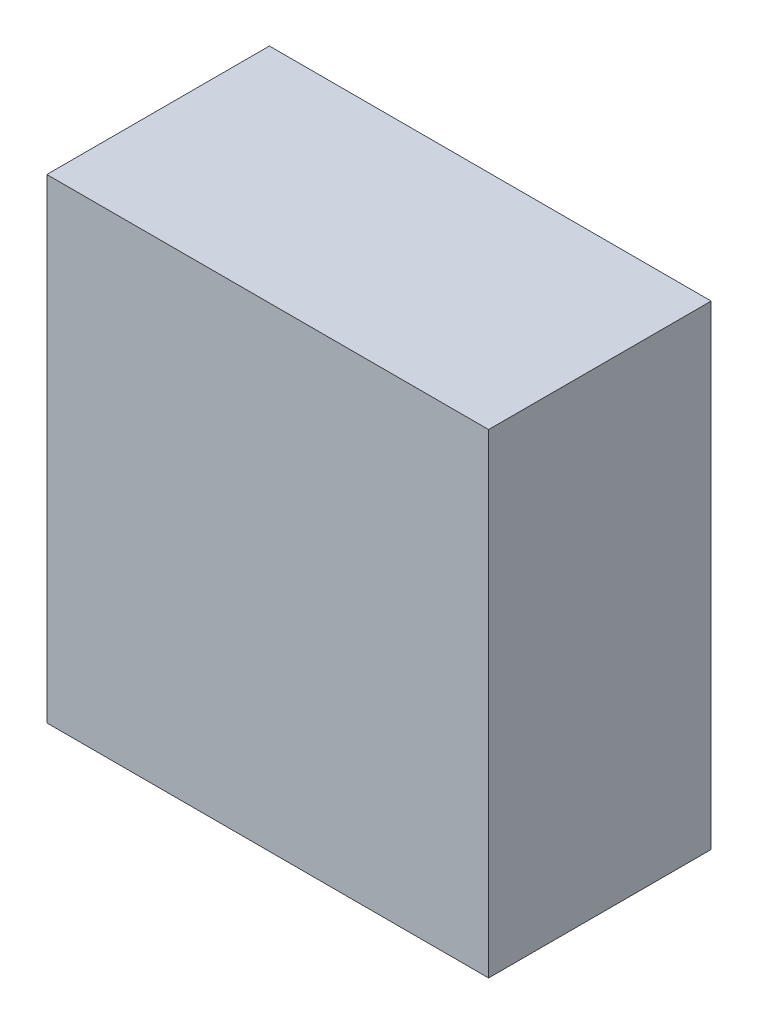
ISO-10303-21;
HEADER;
FILE_DESCRIPTION(('STEP AP214'),'2;1');
FILE_NAME('part.step','',(''),(''),'','','');
FILE_SCHEMA(('AUTOMOTIVE_DESIGN { 1 0 10303 214 1 1 1 1 }'));
ENDSEC;
DATA;
#1=APPLICATION_CONTEXT('core data for automotive mechanical design processes');
#2=APPLICATION_PROTOCOL_DEFINITION('international standard','automotive_design',2000,#1);
#3=PRODUCT_CONTEXT('',#1,'mechanical');
#4=PRODUCT('Part','Part','',(#3));
#5=PRODUCT_RELATED_PRODUCT_CATEGORY('part','',(#4));
#6=PRODUCT_DEFINITION_FORMATION('','',#4);
#7=PRODUCT_DEFINITION_CONTEXT('part definition',#1,'design');
#8=PRODUCT_DEFINITION('design','',#6,#7);
#9=PRODUCT_DEFINITION_SHAPE('','',#8);
#10=(LENGTH_UNIT() NAMED_UNIT(*) SI_UNIT(.MILLI.,.METRE.));
#11=(NAMED_UNIT(*) PLANE_ANGLE_UNIT() SI_UNIT($,.RADIAN.));
#12=(NAMED_UNIT(*) SI_UNIT($,.STERADIAN.) SOLID_ANGLE_UNIT());
#13=UNCERTAINTY_MEASURE_WITH_UNIT(LENGTH_MEASURE(1.E-05),#10,'distance_accuracy_value','');
#14=(GEOMETRIC_REPRESENTATION_CONTEXT(3) GLOBAL_UNCERTAINTY_ASSIGNED_CONTEXT((#13)) GLOBAL_UNIT_ASSIGNED_CONTEXT((#10,
#11,#12)) REPRESENTATION_CONTEXT('',''));
#15=CARTESIAN_POINT('',(0.,0.,0.));
#16=DIRECTION('',(0.,0.,1.));
#17=DIRECTION('',(1.,0.,0.));
#18=AXIS2_PLACEMENT_3D('',#15,#16,#17);
#19=CARTESIAN_POINT('',(-0.00534350019987609,-0.617441590055831,0.404766421000566));
#20=DIRECTION('',(0.,0.,1.));
#21=DIRECTION('',(1.,0.,0.));
#22=AXIS2_PLACEMENT_3D('',#19,#20,#21);
#23=PLANE('',#22);
#24=DIRECTION('',(1.01196828694583E-13,-1.,0.));
#25=VECTOR('',#24,1.);
#26=CARTESIAN_POINT('',(0.0690932947055984,-0.697470191516662,0.404766421000566));
#27=LINE('',#26,#25);
#28=CARTESIAN_POINT('',(0.0690932947055902,-0.537412988594928,0.404766421000566));
#29=VERTEX_POINT('',#28);
#30=CARTESIAN_POINT('',(0.0690932947055984,-0.69747019151667,0.404766421000566));
#31=VERTEX_POINT('',#30);
#32=EDGE_CURVE('E11',#29,#31,#27,.T.);
#33=ORIENTED_EDGE('',*,*,#32,.F.);
#34=DIRECTION('',(1.,1.01196828694583E-13,0.));
#35=VECTOR('',#34,1.);
#36=CARTESIAN_POINT('',(0.0690932947055821,-0.537412988594928,0.404766421000566));
#37=LINE('',#36,#35);
#38=CARTESIAN_POINT('',(-0.0797802951052936,-0.537412988594939,0.404766421000566));
#39=VERTEX_POINT('',#38);
#40=EDGE_CURVE('E24',#39,#29,#37,.T.);
#41=ORIENTED_EDGE('',*,*,#40,.F.);
#42=DIRECTION('',(-1.01196828694583E-13,1.,0.));
#43=VECTOR('',#42,1.);
#44=CARTESIAN_POINT('',(-0.0797802951052936,-0.537412988594943,0.404766421000566));
#45=LINE('',#44,#43);
#46=CARTESIAN_POINT('',(-0.0797802951052855,-0.697470191516678,0.404766421000566));
#47=VERTEX_POINT('',#46);
#48=EDGE_CURVE('E85',#47,#39,#45,.T.);
#49=ORIENTED_EDGE('',*,*,#48,.F.);
#50=DIRECTION('',(-1.,-1.01196828694583E-13,0.));
#51=VECTOR('',#50,1.);
#52=CARTESIAN_POINT('',(0.0690932947055984,-0.697470191516662,0.404766421000566));
#53=LINE('',#52,#51);
#54=EDGE_CURVE('E82',#31,#47,#53,.T.);
#55=ORIENTED_EDGE('',*,*,#54,.F.);
#56=EDGE_LOOP('',(#33,#41,#49,#55));
#57=FACE_BOUND('',#56,.T.);
#58=ADVANCED_FACE('F17',(#57),#23,.T.);
#59=CARTESIAN_POINT('',(-0.0797802951052936,-0.537412988594943,0.379766421000566));
#60=DIRECTION('',(-1.,-1.01196828694583E-13,0.));
#61=DIRECTION('',(1.01196828694583E-13,-1.,0.));
#62=AXIS2_PLACEMENT_3D('',#59,#60,#61);
#63=PLANE('',#62);
#64=ORIENTED_EDGE('',*,*,#48,.T.);
#65=DIRECTION('',(0.,0.,1.));
#66=VECTOR('',#65,1.);
#67=CARTESIAN_POINT('',(-0.0797802951052936,-0.537412988594943,0.379766421000566));
#68=LINE('',#67,#66);
#69=CARTESIAN_POINT('',(-0.0797802951052936,-0.537412988594939,0.329766421000566));
#70=VERTEX_POINT('',#69);
#71=EDGE_CURVE('E80',#70,#39,#68,.T.);
#72=ORIENTED_EDGE('',*,*,#71,.F.);
#73=DIRECTION('',(0.,-1.,0.));
#74=VECTOR('',#73,1.);
#75=CARTESIAN_POINT('',(-0.0797802951052936,-0.617441590055831,0.329766421000566));
#76=LINE('',#75,#74);
#77=CARTESIAN_POINT('',(-0.0797802951052814,-0.697470191516678,0.329766421000566));
#78=VERTEX_POINT('',#77);
#79=EDGE_CURVE('E70',#70,#78,#76,.T.);
#80=ORIENTED_EDGE('',*,*,#79,.T.);
#81=DIRECTION('',(0.,0.,-1.));
#82=VECTOR('',#81,1.);
#83=CARTESIAN_POINT('',(-0.0797802951052773,-0.697470191516678,0.379766421000566));
#84=LINE('',#83,#82);
#85=EDGE_CURVE('E76',#47,#78,#84,.T.);
#86=ORIENTED_EDGE('',*,*,#85,.F.);
#87=EDGE_LOOP('',(#64,#72,#80,#86));
#88=FACE_BOUND('',#87,.T.);
#89=ADVANCED_FACE('F89',(#88),#63,.T.);
#90=CARTESIAN_POINT('',(0.0690932947055984,-0.697470191516662,0.379766421000566));
#91=DIRECTION('',(1.01196828694583E-13,-1.,0.));
#92=DIRECTION('',(1.,1.01196828694583E-13,0.));
#93=AXIS2_PLACEMENT_3D('',#90,#91,#92);
#94=PLANE('',#93);
#95=ORIENTED_EDGE('',*,*,#54,.T.);
#96=ORIENTED_EDGE('',*,*,#85,.T.);
#97=DIRECTION('',(1.,0.,0.));
#98=VECTOR('',#97,1.);
#99=CARTESIAN_POINT('',(-0.00534350019987609,-0.697470191516678,0.329766421000566));
#100=LINE('',#99,#98);
#101=CARTESIAN_POINT('',(0.0690932947055984,-0.697470191516666,0.329766421000566));
#102=VERTEX_POINT('',#101);
#103=EDGE_CURVE('E74',#78,#102,#100,.T.);
#104=ORIENTED_EDGE('',*,*,#103,.T.);
#105=DIRECTION('',(0.,0.,-1.));
#106=VECTOR('',#105,1.);
#107=CARTESIAN_POINT('',(0.0690932947055984,-0.697470191516662,0.379766421000566));
#108=LINE('',#107,#106);
#109=EDGE_CURVE('E57',#31,#102,#108,.T.);
#110=ORIENTED_EDGE('',*,*,#109,.F.);
#111=EDGE_LOOP('',(#95,#96,#104,#110));
#112=FACE_BOUND('',#111,.T.);
#113=ADVANCED_FACE('F91',(#112),#94,.T.);
#114=CARTESIAN_POINT('',(0.0690932947055984,-0.697470191516662,0.379766421000566));
#115=DIRECTION('',(1.,1.01196828694583E-13,0.));
#116=DIRECTION('',(-1.01196828694583E-13,1.,0.));
#117=AXIS2_PLACEMENT_3D('',#114,#115,#116);
#118=PLANE('',#117);
#119=DIRECTION('',(0.,1.,0.));
#120=VECTOR('',#119,1.);
#121=CARTESIAN_POINT('',(0.0690932947055984,-0.617441590055831,0.329766421000566));
#122=LINE('',#121,#120);
#123=CARTESIAN_POINT('',(0.0690932947055862,-0.537412988594928,0.329766421000566));
#124=VERTEX_POINT('',#123);
#125=EDGE_CURVE('E52',#102,#124,#122,.T.);
#126=ORIENTED_EDGE('',*,*,#125,.T.);
#127=DIRECTION('',(0.,0.,-1.));
#128=VECTOR('',#127,1.);
#129=CARTESIAN_POINT('',(0.0690932947055821,-0.537412988594928,0.379766421000566));
#130=LINE('',#129,#128);
#131=EDGE_CURVE('E55',#29,#124,#130,.T.);
#132=ORIENTED_EDGE('',*,*,#131,.F.);
#133=ORIENTED_EDGE('',*,*,#32,.T.);
#134=ORIENTED_EDGE('',*,*,#109,.T.);
#135=EDGE_LOOP('',(#126,#132,#133,#134));
#136=FACE_BOUND('',#135,.T.);
#137=ADVANCED_FACE('F54',(#136),#118,.T.);
#138=CARTESIAN_POINT('',(0.0690932947055821,-0.537412988594928,0.379766421000566));
#139=DIRECTION('',(-1.01196828694583E-13,1.,0.));
#140=DIRECTION('',(-1.,-1.01196828694583E-13,0.));
#141=AXIS2_PLACEMENT_3D('',#138,#139,#140);
#142=PLANE('',#141);
#143=ORIENTED_EDGE('',*,*,#40,.T.);
#144=ORIENTED_EDGE('',*,*,#131,.T.);
#145=DIRECTION('',(-1.,0.,0.));
#146=VECTOR('',#145,1.);
#147=CARTESIAN_POINT('',(-0.00534350019987609,-0.537412988594928,0.329766421000566));
#148=LINE('',#147,#146);
#149=EDGE_CURVE('E66',#124,#70,#148,.T.);
#150=ORIENTED_EDGE('',*,*,#149,.T.);
#151=ORIENTED_EDGE('',*,*,#71,.T.);
#152=EDGE_LOOP('',(#143,#144,#150,#151));
#153=FACE_BOUND('',#152,.T.);
#154=ADVANCED_FACE('F64',(#153),#142,.T.);
#155=CARTESIAN_POINT('',(-0.00534350019987609,-0.617441590055831,0.329766421000566));
#156=DIRECTION('',(0.,0.,1.));
#157=DIRECTION('',(1.,0.,0.));
#158=AXIS2_PLACEMENT_3D('',#155,#156,#157);
#159=PLANE('',#158);
#160=ORIENTED_EDGE('',*,*,#125,.F.);
#161=ORIENTED_EDGE('',*,*,#103,.F.);
#162=ORIENTED_EDGE('',*,*,#79,.F.);
#163=ORIENTED_EDGE('',*,*,#149,.F.);
#164=EDGE_LOOP('',(#160,#161,#162,#163));
#165=FACE_BOUND('',#164,.T.);
#166=ADVANCED_FACE('F69',(#165),#159,.F.);
#167=CLOSED_SHELL('',(#58,#89,#113,#137,#154,#166));
#168=MANIFOLD_SOLID_BREP('B1',#167);
#169=ADVANCED_BREP_SHAPE_REPRESENTATION('',(#18,#168),#14);
#170=SHAPE_DEFINITION_REPRESENTATION(#9,#169);
ENDSEC;
END-ISO-10303-21;
